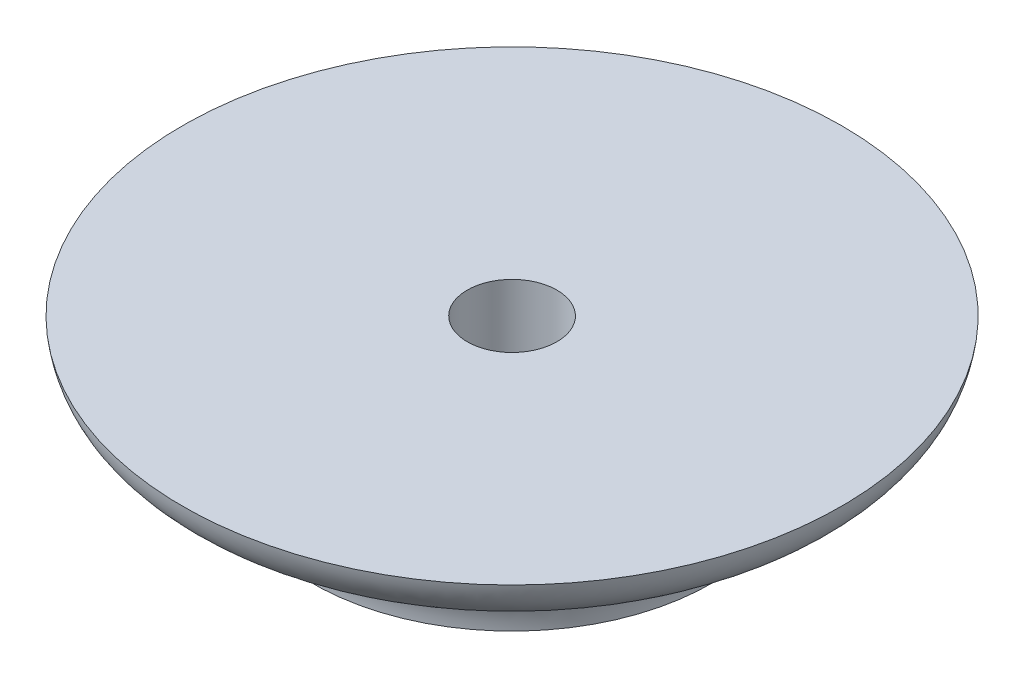
ISO-10303-21;
HEADER;
FILE_DESCRIPTION(('STEP AP214'),'2;1');
FILE_NAME('part.step','',(''),(''),'','','');
FILE_SCHEMA(('AUTOMOTIVE_DESIGN { 1 0 10303 214 1 1 1 1 }'));
ENDSEC;
DATA;
#1=APPLICATION_CONTEXT('core data for automotive mechanical design processes');
#2=APPLICATION_PROTOCOL_DEFINITION('international standard','automotive_design',2000,#1);
#3=PRODUCT_CONTEXT('',#1,'mechanical');
#4=PRODUCT('Part','Part','',(#3));
#5=PRODUCT_RELATED_PRODUCT_CATEGORY('part','',(#4));
#6=PRODUCT_DEFINITION_FORMATION('','',#4);
#7=PRODUCT_DEFINITION_CONTEXT('part definition',#1,'design');
#8=PRODUCT_DEFINITION('design','',#6,#7);
#9=PRODUCT_DEFINITION_SHAPE('','',#8);
#10=(LENGTH_UNIT() NAMED_UNIT(*) SI_UNIT(.MILLI.,.METRE.));
#11=(NAMED_UNIT(*) PLANE_ANGLE_UNIT() SI_UNIT($,.RADIAN.));
#12=(NAMED_UNIT(*) SI_UNIT($,.STERADIAN.) SOLID_ANGLE_UNIT());
#13=UNCERTAINTY_MEASURE_WITH_UNIT(LENGTH_MEASURE(1.E-05),#10,'distance_accuracy_value','');
#14=(GEOMETRIC_REPRESENTATION_CONTEXT(3) GLOBAL_UNCERTAINTY_ASSIGNED_CONTEXT((#13)) GLOBAL_UNIT_ASSIGNED_CONTEXT((#10,
#11,#12)) REPRESENTATION_CONTEXT('',''));
#15=CARTESIAN_POINT('',(0.,0.,0.));
#16=DIRECTION('',(0.,0.,1.));
#17=DIRECTION('',(1.,0.,0.));
#18=AXIS2_PLACEMENT_3D('',#15,#16,#17);
#19=CARTESIAN_POINT('',(0.,0.,0.));
#20=DIRECTION('',(0.,1.,0.));
#21=DIRECTION('',(0.,0.,1.));
#22=AXIS2_PLACEMENT_3D('',#19,#20,#21);
#23=PLANE('',#22);
#24=CARTESIAN_POINT('',(0.,0.,0.));
#25=DIRECTION('',(0.,-1.,0.));
#26=DIRECTION('',(0.,0.,-1.));
#27=AXIS2_PLACEMENT_3D('',#24,#25,#26);
#28=CIRCLE('',#27,1.72719999999999);
#29=CARTESIAN_POINT('',(0.,0.,-1.72719999999999));
#30=VERTEX_POINT('',#29);
#31=EDGE_CURVE('E55',#30,#30,#28,.T.);
#32=ORIENTED_EDGE('',*,*,#31,.F.);
#33=EDGE_LOOP('',(#32));
#34=FACE_BOUND('',#33,.T.);
#35=CARTESIAN_POINT('',(0.,0.,0.));
#36=DIRECTION('',(0.,-1.,0.));
#37=DIRECTION('',(0.,0.,-1.));
#38=AXIS2_PLACEMENT_3D('',#35,#36,#37);
#39=CIRCLE('',#38,7.69411153556579);
#40=CARTESIAN_POINT('',(0.,0.,-7.69411153556579));
#41=VERTEX_POINT('',#40);
#42=EDGE_CURVE('E47',#41,#41,#39,.T.);
#43=ORIENTED_EDGE('',*,*,#42,.T.);
#44=EDGE_LOOP('',(#43));
#45=FACE_BOUND('',#44,.T.);
#46=ADVANCED_FACE('F41',(#34,#45),#23,.F.);
#47=CARTESIAN_POINT('',(0.,5.08,12.7));
#48=CARTESIAN_POINT('',(0.,2.0708057959993,12.29250781001));
#49=CARTESIAN_POINT('',(0.,3.63671140452046,7.69411153556579));
#50=CARTESIAN_POINT('',(0.,0.,7.69411153556579));
#51=B_SPLINE_CURVE_WITH_KNOTS('',3,(#47,#48,#49,#50),.UNSPECIFIED.,.F.,.F.,(4,4),(0.,1.),.UNSPECIFIED.);
#52=CARTESIAN_POINT('',(0.,0.,0.));
#53=DIRECTION('',(0.,-1.,0.));
#54=AXIS1_PLACEMENT('',#52,#53);
#55=SURFACE_OF_REVOLUTION('',#51,#54);
#56=ORIENTED_EDGE('',*,*,#42,.F.);
#57=EDGE_LOOP('',(#56));
#58=FACE_BOUND('',#57,.T.);
#59=CARTESIAN_POINT('',(0.,5.08,0.));
#60=DIRECTION('',(0.,-1.,0.));
#61=DIRECTION('',(0.,0.,-1.));
#62=AXIS2_PLACEMENT_3D('',#59,#60,#61);
#63=CIRCLE('',#62,12.7);
#64=CARTESIAN_POINT('',(0.,5.08,-12.7));
#65=VERTEX_POINT('',#64);
#66=EDGE_CURVE('E10',#65,#65,#63,.T.);
#67=ORIENTED_EDGE('',*,*,#66,.T.);
#68=EDGE_LOOP('',(#67));
#69=FACE_BOUND('',#68,.T.);
#70=ADVANCED_FACE('F66',(#58,#69),#55,.T.);
#71=CARTESIAN_POINT('',(0.,5.08,0.));
#72=DIRECTION('',(0.,1.,0.));
#73=DIRECTION('',(0.,0.,1.));
#74=AXIS2_PLACEMENT_3D('',#71,#72,#73);
#75=PLANE('',#74);
#76=CARTESIAN_POINT('',(0.,5.08,0.));
#77=DIRECTION('',(0.,-1.,0.));
#78=DIRECTION('',(0.,0.,-1.));
#79=AXIS2_PLACEMENT_3D('',#76,#77,#78);
#80=CIRCLE('',#79,1.7272);
#81=CARTESIAN_POINT('',(0.,5.08,-1.7272));
#82=VERTEX_POINT('',#81);
#83=EDGE_CURVE('E51',#82,#82,#80,.T.);
#84=ORIENTED_EDGE('',*,*,#83,.T.);
#85=EDGE_LOOP('',(#84));
#86=FACE_BOUND('',#85,.T.);
#87=ORIENTED_EDGE('',*,*,#66,.F.);
#88=EDGE_LOOP('',(#87));
#89=FACE_BOUND('',#88,.T.);
#90=ADVANCED_FACE('F69',(#86,#89),#75,.T.);
#91=CARTESIAN_POINT('',(0.,0.,0.));
#92=DIRECTION('',(0.,-1.,0.));
#93=DIRECTION('',(0.,0.,-1.));
#94=AXIS2_PLACEMENT_3D('',#91,#92,#93);
#95=CYLINDRICAL_SURFACE('',#94,1.72719999999999);
#96=ORIENTED_EDGE('',*,*,#83,.F.);
#97=EDGE_LOOP('',(#96));
#98=FACE_BOUND('',#97,.T.);
#99=ORIENTED_EDGE('',*,*,#31,.T.);
#100=EDGE_LOOP('',(#99));
#101=FACE_BOUND('',#100,.T.);
#102=ADVANCED_FACE('F71',(#98,#101),#95,.F.);
#103=CLOSED_SHELL('',(#46,#70,#90,#102));
#104=MANIFOLD_SOLID_BREP('B2',#103);
#105=ADVANCED_BREP_SHAPE_REPRESENTATION('',(#18,#104),#14);
#106=SHAPE_DEFINITION_REPRESENTATION(#9,#105);
ENDSEC;
END-ISO-10303-21;
